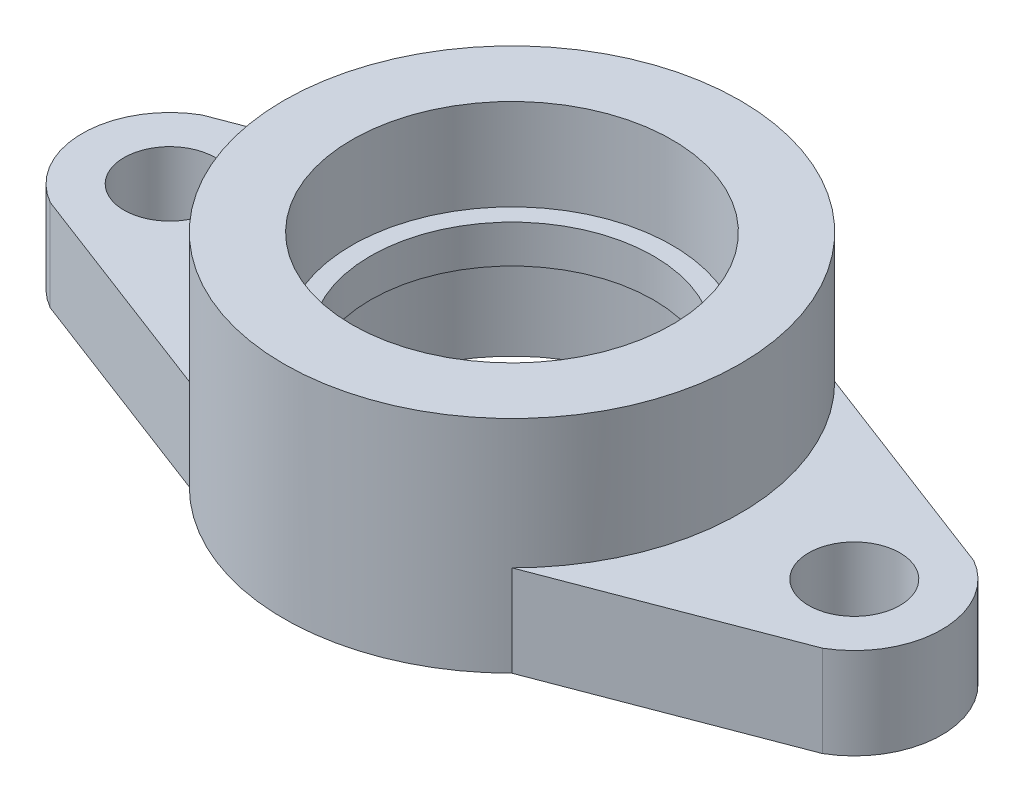
ISO-10303-21;
HEADER;
FILE_DESCRIPTION(('STEP AP214'),'2;1');
FILE_NAME('part.step','',(''),(''),'','','');
FILE_SCHEMA(('AUTOMOTIVE_DESIGN { 1 0 10303 214 1 1 1 1 }'));
ENDSEC;
DATA;
#1=APPLICATION_CONTEXT('core data for automotive mechanical design processes');
#2=APPLICATION_PROTOCOL_DEFINITION('international standard','automotive_design',2000,#1);
#3=PRODUCT_CONTEXT('',#1,'mechanical');
#4=PRODUCT('Part','Part','',(#3));
#5=PRODUCT_RELATED_PRODUCT_CATEGORY('part','',(#4));
#6=PRODUCT_DEFINITION_FORMATION('','',#4);
#7=PRODUCT_DEFINITION_CONTEXT('part definition',#1,'design');
#8=PRODUCT_DEFINITION('design','',#6,#7);
#9=PRODUCT_DEFINITION_SHAPE('','',#8);
#10=(LENGTH_UNIT() NAMED_UNIT(*) SI_UNIT(.MILLI.,.METRE.));
#11=(NAMED_UNIT(*) PLANE_ANGLE_UNIT() SI_UNIT($,.RADIAN.));
#12=(NAMED_UNIT(*) SI_UNIT($,.STERADIAN.) SOLID_ANGLE_UNIT());
#13=UNCERTAINTY_MEASURE_WITH_UNIT(LENGTH_MEASURE(1.E-05),#10,'distance_accuracy_value','');
#14=(GEOMETRIC_REPRESENTATION_CONTEXT(3) GLOBAL_UNCERTAINTY_ASSIGNED_CONTEXT((#13)) GLOBAL_UNIT_ASSIGNED_CONTEXT((#10,
#11,#12)) REPRESENTATION_CONTEXT('',''));
#15=CARTESIAN_POINT('',(0.,0.,0.));
#16=DIRECTION('',(0.,0.,1.));
#17=DIRECTION('',(1.,0.,0.));
#18=AXIS2_PLACEMENT_3D('',#15,#16,#17);
#19=CARTESIAN_POINT('',(45.,12.,0.));
#20=DIRECTION('',(0.,-1.,0.));
#21=DIRECTION('',(0.,0.,-1.));
#22=AXIS2_PLACEMENT_3D('',#19,#20,#21);
#23=PLANE('',#22);
#24=DIRECTION('',(-0.934468806462476,0.,0.356045010846375));
#25=VECTOR('',#24,1.);
#26=CARTESIAN_POINT('',(21.2132034355965,12.,21.2132034355964));
#27=LINE('',#26,#25);
#28=CARTESIAN_POINT('',(50.75,12.,9.95929214352107));
#29=VERTEX_POINT('',#28);
#30=CARTESIAN_POINT('',(21.2132034355965,12.,21.2132034355964));
#31=VERTEX_POINT('',#30);
#32=EDGE_CURVE('E100',#29,#31,#27,.T.);
#33=ORIENTED_EDGE('',*,*,#32,.F.);
#34=CARTESIAN_POINT('',(45.,12.,0.));
#35=DIRECTION('',(0.,1.,0.));
#36=DIRECTION('',(0.,0.,-1.));
#37=AXIS2_PLACEMENT_3D('',#34,#35,#36);
#38=CIRCLE('',#37,11.5);
#39=CARTESIAN_POINT('',(50.75,12.,-9.95929214352106));
#40=VERTEX_POINT('',#39);
#41=EDGE_CURVE('E128',#29,#40,#38,.T.);
#42=ORIENTED_EDGE('',*,*,#41,.T.);
#43=DIRECTION('',(-0.934468806462476,0.,-0.356045010846375));
#44=VECTOR('',#43,1.);
#45=CARTESIAN_POINT('',(21.2132034355965,12.,-21.2132034355964));
#46=LINE('',#45,#44);
#47=CARTESIAN_POINT('',(21.2132034355965,12.,-21.2132034355964));
#48=VERTEX_POINT('',#47);
#49=EDGE_CURVE('E55',#40,#48,#46,.T.);
#50=ORIENTED_EDGE('',*,*,#49,.T.);
#51=CARTESIAN_POINT('',(0.,12.,0.));
#52=DIRECTION('',(0.,1.,0.));
#53=DIRECTION('',(0.,0.,-1.));
#54=AXIS2_PLACEMENT_3D('',#51,#52,#53);
#55=CIRCLE('',#54,30.);
#56=EDGE_CURVE('E72',#31,#48,#55,.T.);
#57=ORIENTED_EDGE('',*,*,#56,.F.);
#58=EDGE_LOOP('',(#33,#42,#50,#57));
#59=FACE_BOUND('',#58,.T.);
#60=CARTESIAN_POINT('',(45.,12.,0.));
#61=DIRECTION('',(0.,-1.,0.));
#62=DIRECTION('',(0.,0.,-1.));
#63=AXIS2_PLACEMENT_3D('',#60,#61,#62);
#64=CIRCLE('',#63,6.00000000000001);
#65=CARTESIAN_POINT('',(45.,12.,-6.));
#66=VERTEX_POINT('',#65);
#67=EDGE_CURVE('E125',#66,#66,#64,.T.);
#68=ORIENTED_EDGE('',*,*,#67,.T.);
#69=EDGE_LOOP('',(#68));
#70=FACE_BOUND('',#69,.T.);
#71=ADVANCED_FACE('F38',(#59,#70),#23,.F.);
#72=CARTESIAN_POINT('',(45.,12.,0.));
#73=DIRECTION('',(0.,-1.,0.));
#74=DIRECTION('',(0.,0.,-1.));
#75=AXIS2_PLACEMENT_3D('',#72,#73,#74);
#76=CYLINDRICAL_SURFACE('',#75,6.00000000000001);
#77=CARTESIAN_POINT('',(45.,0.,0.));
#78=DIRECTION('',(0.,-1.,0.));
#79=DIRECTION('',(0.,0.,-1.));
#80=AXIS2_PLACEMENT_3D('',#77,#78,#79);
#81=CIRCLE('',#80,6.00000000000001);
#82=CARTESIAN_POINT('',(45.,0.,-6.));
#83=VERTEX_POINT('',#82);
#84=EDGE_CURVE('E123',#83,#83,#81,.T.);
#85=ORIENTED_EDGE('',*,*,#84,.T.);
#86=EDGE_LOOP('',(#85));
#87=FACE_BOUND('',#86,.T.);
#88=ORIENTED_EDGE('',*,*,#67,.F.);
#89=EDGE_LOOP('',(#88));
#90=FACE_BOUND('',#89,.T.);
#91=ADVANCED_FACE('F40',(#87,#90),#76,.F.);
#92=CARTESIAN_POINT('',(45.,12.,0.));
#93=DIRECTION('',(0.,-1.,0.));
#94=DIRECTION('',(0.,0.,-1.));
#95=AXIS2_PLACEMENT_3D('',#92,#93,#94);
#96=CYLINDRICAL_SURFACE('',#95,11.5);
#97=CARTESIAN_POINT('',(45.,0.,0.));
#98=DIRECTION('',(0.,1.,0.));
#99=DIRECTION('',(0.,0.,-1.));
#100=AXIS2_PLACEMENT_3D('',#97,#98,#99);
#101=CIRCLE('',#100,11.5);
#102=CARTESIAN_POINT('',(50.75,0.,9.95929214352107));
#103=VERTEX_POINT('',#102);
#104=CARTESIAN_POINT('',(50.75,0.,-9.95929214352106));
#105=VERTEX_POINT('',#104);
#106=EDGE_CURVE('E66',#103,#105,#101,.T.);
#107=ORIENTED_EDGE('',*,*,#106,.T.);
#108=DIRECTION('',(0.,-1.,0.));
#109=VECTOR('',#108,1.);
#110=CARTESIAN_POINT('',(50.75,12.,-9.95929214352106));
#111=LINE('',#110,#109);
#112=EDGE_CURVE('E11',#40,#105,#111,.T.);
#113=ORIENTED_EDGE('',*,*,#112,.F.);
#114=ORIENTED_EDGE('',*,*,#41,.F.);
#115=DIRECTION('',(0.,-1.,0.));
#116=VECTOR('',#115,1.);
#117=CARTESIAN_POINT('',(50.75,12.,9.95929214352107));
#118=LINE('',#117,#116);
#119=EDGE_CURVE('E107',#29,#103,#118,.T.);
#120=ORIENTED_EDGE('',*,*,#119,.T.);
#121=EDGE_LOOP('',(#107,#113,#114,#120));
#122=FACE_BOUND('',#121,.T.);
#123=ADVANCED_FACE('F235',(#122),#96,.T.);
#124=CARTESIAN_POINT('',(21.2132034355965,12.,-21.2132034355964));
#125=DIRECTION('',(-0.356045010846375,0.,0.934468806462476));
#126=DIRECTION('',(0.934468806462476,0.,0.356045010846375));
#127=AXIS2_PLACEMENT_3D('',#124,#125,#126);
#128=PLANE('',#127);
#129=DIRECTION('',(-0.934468806462476,0.,-0.356045010846375));
#130=VECTOR('',#129,1.);
#131=CARTESIAN_POINT('',(21.2132034355965,0.,-21.2132034355964));
#132=LINE('',#131,#130);
#133=CARTESIAN_POINT('',(21.2132034355965,0.,-21.2132034355964));
#134=VERTEX_POINT('',#133);
#135=EDGE_CURVE('E135',#105,#134,#132,.T.);
#136=ORIENTED_EDGE('',*,*,#135,.T.);
#137=DIRECTION('',(0.,-1.,0.));
#138=VECTOR('',#137,1.);
#139=CARTESIAN_POINT('',(21.2132034355965,12.,-21.2132034355964));
#140=LINE('',#139,#138);
#141=EDGE_CURVE('E47',#48,#134,#140,.T.);
#142=ORIENTED_EDGE('',*,*,#141,.F.);
#143=ORIENTED_EDGE('',*,*,#49,.F.);
#144=ORIENTED_EDGE('',*,*,#112,.T.);
#145=EDGE_LOOP('',(#136,#142,#143,#144));
#146=FACE_BOUND('',#145,.T.);
#147=ADVANCED_FACE('F227',(#146),#128,.F.);
#148=CARTESIAN_POINT('',(0.,12.,1.04083408558608E-13));
#149=DIRECTION('',(0.,-1.,0.));
#150=DIRECTION('',(0.,0.,-1.));
#151=AXIS2_PLACEMENT_3D('',#148,#149,#150);
#152=CYLINDRICAL_SURFACE('',#151,30.0000000000001);
#153=CARTESIAN_POINT('',(0.,0.,1.04083408558608E-13));
#154=DIRECTION('',(0.,1.,0.));
#155=DIRECTION('',(0.,0.,-1.));
#156=AXIS2_PLACEMENT_3D('',#153,#154,#155);
#157=CIRCLE('',#156,30.0000000000001);
#158=CARTESIAN_POINT('',(-21.2132034355965,0.,-21.2132034355964));
#159=VERTEX_POINT('',#158);
#160=EDGE_CURVE('E129',#134,#159,#157,.T.);
#161=ORIENTED_EDGE('',*,*,#160,.T.);
#162=DIRECTION('',(0.,-1.,0.));
#163=VECTOR('',#162,1.);
#164=CARTESIAN_POINT('',(-21.2132034355965,12.,-21.2132034355964));
#165=LINE('',#164,#163);
#166=CARTESIAN_POINT('',(-21.2132034355965,12.,-21.2132034355964));
#167=VERTEX_POINT('',#166);
#168=EDGE_CURVE('E115',#167,#159,#165,.T.);
#169=ORIENTED_EDGE('',*,*,#168,.F.);
#170=CARTESIAN_POINT('',(0.,12.,0.));
#171=DIRECTION('',(0.,-1.,0.));
#172=DIRECTION('',(0.,0.,-1.));
#173=AXIS2_PLACEMENT_3D('',#170,#171,#172);
#174=CIRCLE('',#173,30.);
#175=CARTESIAN_POINT('',(-21.2132034355965,12.,21.2132034355964));
#176=VERTEX_POINT('',#175);
#177=EDGE_CURVE('E170',#176,#167,#174,.T.);
#178=ORIENTED_EDGE('',*,*,#177,.F.);
#179=DIRECTION('',(0.,-1.,0.));
#180=VECTOR('',#179,1.);
#181=CARTESIAN_POINT('',(-21.2132034355965,12.,21.2132034355964));
#182=LINE('',#181,#180);
#183=CARTESIAN_POINT('',(-21.2132034355965,0.,21.2132034355964));
#184=VERTEX_POINT('',#183);
#185=EDGE_CURVE('E95',#176,#184,#182,.T.);
#186=ORIENTED_EDGE('',*,*,#185,.T.);
#187=CARTESIAN_POINT('',(0.,0.,-1.04083408558608E-13));
#188=DIRECTION('',(0.,-1.,0.));
#189=DIRECTION('',(0.,0.,1.));
#190=AXIS2_PLACEMENT_3D('',#187,#188,#189);
#191=CIRCLE('',#190,30.0000000000001);
#192=CARTESIAN_POINT('',(21.2132034355965,0.,21.2132034355964));
#193=VERTEX_POINT('',#192);
#194=EDGE_CURVE('E85',#193,#184,#191,.T.);
#195=ORIENTED_EDGE('',*,*,#194,.F.);
#196=DIRECTION('',(0.,-1.,0.));
#197=VECTOR('',#196,1.);
#198=CARTESIAN_POINT('',(21.2132034355965,12.,21.2132034355964));
#199=LINE('',#198,#197);
#200=EDGE_CURVE('E90',#31,#193,#199,.T.);
#201=ORIENTED_EDGE('',*,*,#200,.F.);
#202=ORIENTED_EDGE('',*,*,#56,.T.);
#203=ORIENTED_EDGE('',*,*,#141,.T.);
#204=EDGE_LOOP('',(#161,#169,#178,#186,#195,#201,#202,#203));
#205=FACE_BOUND('',#204,.T.);
#206=CARTESIAN_POINT('',(0.,29.,0.));
#207=DIRECTION('',(0.,1.,0.));
#208=DIRECTION('',(0.,0.,-1.));
#209=AXIS2_PLACEMENT_3D('',#206,#207,#208);
#210=CIRCLE('',#209,30.);
#211=CARTESIAN_POINT('',(0.,29.,-30.));
#212=VERTEX_POINT('',#211);
#213=EDGE_CURVE('E120',#212,#212,#210,.T.);
#214=ORIENTED_EDGE('',*,*,#213,.F.);
#215=EDGE_LOOP('',(#214));
#216=FACE_BOUND('',#215,.T.);
#217=ADVANCED_FACE('F88',(#205,#216),#152,.T.);
#218=CARTESIAN_POINT('',(45.,0.,0.));
#219=DIRECTION('',(0.,-1.,0.));
#220=DIRECTION('',(0.,0.,-1.));
#221=AXIS2_PLACEMENT_3D('',#218,#219,#220);
#222=PLANE('',#221);
#223=CARTESIAN_POINT('',(0.,0.,0.));
#224=DIRECTION('',(0.,1.,0.));
#225=DIRECTION('',(0.,0.,1.));
#226=AXIS2_PLACEMENT_3D('',#223,#224,#225);
#227=CIRCLE('',#226,21.05);
#228=CARTESIAN_POINT('',(0.,0.,21.05));
#229=VERTEX_POINT('',#228);
#230=EDGE_CURVE('E192',#229,#229,#227,.T.);
#231=ORIENTED_EDGE('',*,*,#230,.T.);
#232=EDGE_LOOP('',(#231));
#233=FACE_BOUND('',#232,.T.);
#234=ORIENTED_EDGE('',*,*,#106,.F.);
#235=DIRECTION('',(-0.934468806462476,0.,0.356045010846375));
#236=VECTOR('',#235,1.);
#237=CARTESIAN_POINT('',(21.2132034355965,0.,21.2132034355964));
#238=LINE('',#237,#236);
#239=EDGE_CURVE('E101',#103,#193,#238,.T.);
#240=ORIENTED_EDGE('',*,*,#239,.T.);
#241=ORIENTED_EDGE('',*,*,#194,.T.);
#242=DIRECTION('',(0.934468806462476,0.,0.356045010846375));
#243=VECTOR('',#242,1.);
#244=CARTESIAN_POINT('',(-21.2132034355965,0.,21.2132034355964));
#245=LINE('',#244,#243);
#246=CARTESIAN_POINT('',(-50.75,0.,9.95929214352106));
#247=VERTEX_POINT('',#246);
#248=EDGE_CURVE('E182',#247,#184,#245,.T.);
#249=ORIENTED_EDGE('',*,*,#248,.F.);
#250=CARTESIAN_POINT('',(-45.,0.,0.));
#251=DIRECTION('',(0.,-1.,0.));
#252=DIRECTION('',(0.,0.,-1.));
#253=AXIS2_PLACEMENT_3D('',#250,#251,#252);
#254=CIRCLE('',#253,11.5);
#255=CARTESIAN_POINT('',(-50.75,0.,-9.95929214352106));
#256=VERTEX_POINT('',#255);
#257=EDGE_CURVE('E149',#247,#256,#254,.T.);
#258=ORIENTED_EDGE('',*,*,#257,.T.);
#259=DIRECTION('',(0.934468806462476,0.,-0.356045010846375));
#260=VECTOR('',#259,1.);
#261=CARTESIAN_POINT('',(-21.2132034355965,0.,-21.2132034355964));
#262=LINE('',#261,#260);
#263=EDGE_CURVE('E146',#256,#159,#262,.T.);
#264=ORIENTED_EDGE('',*,*,#263,.T.);
#265=ORIENTED_EDGE('',*,*,#160,.F.);
#266=ORIENTED_EDGE('',*,*,#135,.F.);
#267=EDGE_LOOP('',(#234,#240,#241,#249,#258,#264,#265,#266));
#268=FACE_BOUND('',#267,.T.);
#269=ORIENTED_EDGE('',*,*,#84,.F.);
#270=EDGE_LOOP('',(#269));
#271=FACE_BOUND('',#270,.T.);
#272=CARTESIAN_POINT('',(-45.,0.,0.));
#273=DIRECTION('',(0.,1.,0.));
#274=DIRECTION('',(0.,0.,-1.));
#275=AXIS2_PLACEMENT_3D('',#272,#273,#274);
#276=CIRCLE('',#275,6.00000000000001);
#277=CARTESIAN_POINT('',(-45.,0.,-6.));
#278=VERTEX_POINT('',#277);
#279=EDGE_CURVE('E158',#278,#278,#276,.T.);
#280=ORIENTED_EDGE('',*,*,#279,.T.);
#281=EDGE_LOOP('',(#280));
#282=FACE_BOUND('',#281,.T.);
#283=ADVANCED_FACE('F109',(#233,#268,#271,#282),#222,.T.);
#284=CARTESIAN_POINT('',(0.,29.,0.));
#285=DIRECTION('',(0.,-1.,0.));
#286=DIRECTION('',(0.,0.,-1.));
#287=AXIS2_PLACEMENT_3D('',#284,#285,#286);
#288=PLANE('',#287);
#289=CARTESIAN_POINT('',(0.,29.,0.));
#290=DIRECTION('',(0.,1.,0.));
#291=DIRECTION('',(0.,0.,1.));
#292=AXIS2_PLACEMENT_3D('',#289,#290,#291);
#293=CIRCLE('',#292,21.05);
#294=CARTESIAN_POINT('',(0.,29.,21.05));
#295=VERTEX_POINT('',#294);
#296=EDGE_CURVE('E186',#295,#295,#293,.T.);
#297=ORIENTED_EDGE('',*,*,#296,.F.);
#298=EDGE_LOOP('',(#297));
#299=FACE_BOUND('',#298,.T.);
#300=ORIENTED_EDGE('',*,*,#213,.T.);
#301=EDGE_LOOP('',(#300));
#302=FACE_BOUND('',#301,.T.);
#303=ADVANCED_FACE('F221',(#299,#302),#288,.F.);
#304=CARTESIAN_POINT('',(21.2132034355965,12.,21.2132034355964));
#305=DIRECTION('',(-0.356045010846375,0.,-0.934468806462476));
#306=DIRECTION('',(0.934468806462476,0.,-0.356045010846375));
#307=AXIS2_PLACEMENT_3D('',#304,#305,#306);
#308=PLANE('',#307);
#309=ORIENTED_EDGE('',*,*,#239,.F.);
#310=ORIENTED_EDGE('',*,*,#119,.F.);
#311=ORIENTED_EDGE('',*,*,#32,.T.);
#312=ORIENTED_EDGE('',*,*,#200,.T.);
#313=EDGE_LOOP('',(#309,#310,#311,#312));
#314=FACE_BOUND('',#313,.T.);
#315=ADVANCED_FACE('F105',(#314),#308,.F.);
#316=CARTESIAN_POINT('',(-45.,12.,0.));
#317=DIRECTION('',(0.,-1.,0.));
#318=DIRECTION('',(0.,0.,-1.));
#319=AXIS2_PLACEMENT_3D('',#316,#317,#318);
#320=PLANE('',#319);
#321=CARTESIAN_POINT('',(-45.,12.,0.));
#322=DIRECTION('',(0.,-1.,0.));
#323=DIRECTION('',(0.,0.,-1.));
#324=AXIS2_PLACEMENT_3D('',#321,#322,#323);
#325=CIRCLE('',#324,11.5);
#326=CARTESIAN_POINT('',(-50.75,12.,9.95929214352106));
#327=VERTEX_POINT('',#326);
#328=CARTESIAN_POINT('',(-50.75,12.,-9.95929214352106));
#329=VERTEX_POINT('',#328);
#330=EDGE_CURVE('E156',#327,#329,#325,.T.);
#331=ORIENTED_EDGE('',*,*,#330,.F.);
#332=DIRECTION('',(0.934468806462476,0.,0.356045010846375));
#333=VECTOR('',#332,1.);
#334=CARTESIAN_POINT('',(-21.2132034355965,12.,21.2132034355964));
#335=LINE('',#334,#333);
#336=EDGE_CURVE('E181',#327,#176,#335,.T.);
#337=ORIENTED_EDGE('',*,*,#336,.T.);
#338=ORIENTED_EDGE('',*,*,#177,.T.);
#339=DIRECTION('',(0.934468806462476,0.,-0.356045010846375));
#340=VECTOR('',#339,1.);
#341=CARTESIAN_POINT('',(-21.2132034355965,12.,-21.2132034355964));
#342=LINE('',#341,#340);
#343=EDGE_CURVE('E162',#329,#167,#342,.T.);
#344=ORIENTED_EDGE('',*,*,#343,.F.);
#345=EDGE_LOOP('',(#331,#337,#338,#344));
#346=FACE_BOUND('',#345,.T.);
#347=CARTESIAN_POINT('',(-45.,12.,0.));
#348=DIRECTION('',(0.,1.,0.));
#349=DIRECTION('',(0.,0.,-1.));
#350=AXIS2_PLACEMENT_3D('',#347,#348,#349);
#351=CIRCLE('',#350,6.00000000000001);
#352=CARTESIAN_POINT('',(-45.,12.,-6.));
#353=VERTEX_POINT('',#352);
#354=EDGE_CURVE('E153',#353,#353,#351,.T.);
#355=ORIENTED_EDGE('',*,*,#354,.F.);
#356=EDGE_LOOP('',(#355));
#357=FACE_BOUND('',#356,.T.);
#358=ADVANCED_FACE('F247',(#346,#357),#320,.F.);
#359=CARTESIAN_POINT('',(-45.,12.,0.));
#360=DIRECTION('',(0.,-1.,0.));
#361=DIRECTION('',(0.,0.,-1.));
#362=AXIS2_PLACEMENT_3D('',#359,#360,#361);
#363=CYLINDRICAL_SURFACE('',#362,6.00000000000001);
#364=ORIENTED_EDGE('',*,*,#279,.F.);
#365=EDGE_LOOP('',(#364));
#366=FACE_BOUND('',#365,.T.);
#367=ORIENTED_EDGE('',*,*,#354,.T.);
#368=EDGE_LOOP('',(#367));
#369=FACE_BOUND('',#368,.T.);
#370=ADVANCED_FACE('F248',(#366,#369),#363,.F.);
#371=CARTESIAN_POINT('',(-45.,12.,0.));
#372=DIRECTION('',(0.,-1.,0.));
#373=DIRECTION('',(0.,0.,-1.));
#374=AXIS2_PLACEMENT_3D('',#371,#372,#373);
#375=CYLINDRICAL_SURFACE('',#374,11.5);
#376=ORIENTED_EDGE('',*,*,#257,.F.);
#377=DIRECTION('',(0.,-1.,0.));
#378=VECTOR('',#377,1.);
#379=CARTESIAN_POINT('',(-50.75,12.,9.95929214352106));
#380=LINE('',#379,#378);
#381=EDGE_CURVE('E173',#327,#247,#380,.T.);
#382=ORIENTED_EDGE('',*,*,#381,.F.);
#383=ORIENTED_EDGE('',*,*,#330,.T.);
#384=DIRECTION('',(0.,-1.,0.));
#385=VECTOR('',#384,1.);
#386=CARTESIAN_POINT('',(-50.75,12.,-9.95929214352106));
#387=LINE('',#386,#385);
#388=EDGE_CURVE('E112',#329,#256,#387,.T.);
#389=ORIENTED_EDGE('',*,*,#388,.T.);
#390=EDGE_LOOP('',(#376,#382,#383,#389));
#391=FACE_BOUND('',#390,.T.);
#392=ADVANCED_FACE('F251',(#391),#375,.T.);
#393=CARTESIAN_POINT('',(-21.2132034355965,12.,-21.2132034355964));
#394=DIRECTION('',(0.356045010846375,0.,0.934468806462476));
#395=DIRECTION('',(-0.934468806462476,0.,0.356045010846375));
#396=AXIS2_PLACEMENT_3D('',#393,#394,#395);
#397=PLANE('',#396);
#398=ORIENTED_EDGE('',*,*,#263,.F.);
#399=ORIENTED_EDGE('',*,*,#388,.F.);
#400=ORIENTED_EDGE('',*,*,#343,.T.);
#401=ORIENTED_EDGE('',*,*,#168,.T.);
#402=EDGE_LOOP('',(#398,#399,#400,#401));
#403=FACE_BOUND('',#402,.T.);
#404=ADVANCED_FACE('F255',(#403),#397,.F.);
#405=CARTESIAN_POINT('',(-21.2132034355965,12.,21.2132034355964));
#406=DIRECTION('',(0.356045010846375,0.,-0.934468806462476));
#407=DIRECTION('',(-0.934468806462476,0.,-0.356045010846375));
#408=AXIS2_PLACEMENT_3D('',#405,#406,#407);
#409=PLANE('',#408);
#410=ORIENTED_EDGE('',*,*,#248,.T.);
#411=ORIENTED_EDGE('',*,*,#185,.F.);
#412=ORIENTED_EDGE('',*,*,#336,.F.);
#413=ORIENTED_EDGE('',*,*,#381,.T.);
#414=EDGE_LOOP('',(#410,#411,#412,#413));
#415=FACE_BOUND('',#414,.T.);
#416=ADVANCED_FACE('F217',(#415),#409,.F.);
#417=CARTESIAN_POINT('',(0.,17.,0.));
#418=DIRECTION('',(0.,1.,0.));
#419=DIRECTION('',(0.,0.,1.));
#420=AXIS2_PLACEMENT_3D('',#417,#418,#419);
#421=CYLINDRICAL_SURFACE('',#420,21.05);
#422=CARTESIAN_POINT('',(0.,17.,0.));
#423=DIRECTION('',(0.,1.,0.));
#424=DIRECTION('',(0.,0.,1.));
#425=AXIS2_PLACEMENT_3D('',#422,#423,#424);
#426=CIRCLE('',#425,21.05);
#427=CARTESIAN_POINT('',(0.,17.,21.05));
#428=VERTEX_POINT('',#427);
#429=EDGE_CURVE('E184',#428,#428,#426,.T.);
#430=ORIENTED_EDGE('',*,*,#429,.F.);
#431=EDGE_LOOP('',(#430));
#432=FACE_BOUND('',#431,.T.);
#433=ORIENTED_EDGE('',*,*,#296,.T.);
#434=EDGE_LOOP('',(#433));
#435=FACE_BOUND('',#434,.T.);
#436=ADVANCED_FACE('F211',(#432,#435),#421,.F.);
#437=CARTESIAN_POINT('',(0.,17.,0.));
#438=DIRECTION('',(0.,1.,0.));
#439=DIRECTION('',(0.,0.,1.));
#440=AXIS2_PLACEMENT_3D('',#437,#438,#439);
#441=PLANE('',#440);
#442=CARTESIAN_POINT('',(0.,17.,0.));
#443=DIRECTION('',(0.,1.,0.));
#444=DIRECTION('',(0.,0.,1.));
#445=AXIS2_PLACEMENT_3D('',#442,#443,#444);
#446=CIRCLE('',#445,18.6);
#447=CARTESIAN_POINT('',(0.,17.,18.6));
#448=VERTEX_POINT('',#447);
#449=EDGE_CURVE('E200',#448,#448,#446,.T.);
#450=ORIENTED_EDGE('',*,*,#449,.F.);
#451=EDGE_LOOP('',(#450));
#452=FACE_BOUND('',#451,.T.);
#453=ORIENTED_EDGE('',*,*,#429,.T.);
#454=EDGE_LOOP('',(#453));
#455=FACE_BOUND('',#454,.T.);
#456=ADVANCED_FACE('F207',(#452,#455),#441,.T.);
#457=CARTESIAN_POINT('',(0.,12.,0.));
#458=DIRECTION('',(0.,-1.,0.));
#459=DIRECTION('',(0.,0.,-1.));
#460=AXIS2_PLACEMENT_3D('',#457,#458,#459);
#461=CYLINDRICAL_SURFACE('',#460,21.05);
#462=CARTESIAN_POINT('',(0.,12.,0.));
#463=DIRECTION('',(0.,1.,0.));
#464=DIRECTION('',(0.,0.,1.));
#465=AXIS2_PLACEMENT_3D('',#462,#463,#464);
#466=CIRCLE('',#465,21.05);
#467=CARTESIAN_POINT('',(0.,12.,21.05));
#468=VERTEX_POINT('',#467);
#469=EDGE_CURVE('E189',#468,#468,#466,.T.);
#470=ORIENTED_EDGE('',*,*,#469,.T.);
#471=EDGE_LOOP('',(#470));
#472=FACE_BOUND('',#471,.T.);
#473=ORIENTED_EDGE('',*,*,#230,.F.);
#474=EDGE_LOOP('',(#473));
#475=FACE_BOUND('',#474,.T.);
#476=ADVANCED_FACE('F210',(#472,#475),#461,.F.);
#477=CARTESIAN_POINT('',(0.,12.,0.));
#478=DIRECTION('',(0.,-1.,0.));
#479=DIRECTION('',(0.,0.,1.));
#480=AXIS2_PLACEMENT_3D('',#477,#478,#479);
#481=PLANE('',#480);
#482=CARTESIAN_POINT('',(0.,12.,0.));
#483=DIRECTION('',(0.,-1.,0.));
#484=DIRECTION('',(0.,0.,-1.));
#485=AXIS2_PLACEMENT_3D('',#482,#483,#484);
#486=CIRCLE('',#485,18.6);
#487=CARTESIAN_POINT('',(0.,12.,18.6));
#488=VERTEX_POINT('',#487);
#489=EDGE_CURVE('E195',#488,#488,#486,.F.);
#490=ORIENTED_EDGE('',*,*,#489,.T.);
#491=EDGE_LOOP('',(#490));
#492=FACE_BOUND('',#491,.T.);
#493=ORIENTED_EDGE('',*,*,#469,.F.);
#494=EDGE_LOOP('',(#493));
#495=FACE_BOUND('',#494,.T.);
#496=ADVANCED_FACE('F266',(#492,#495),#481,.T.);
#497=CARTESIAN_POINT('',(0.,-40.6087445202791,0.));
#498=DIRECTION('',(0.,1.,0.));
#499=DIRECTION('',(0.,0.,1.));
#500=AXIS2_PLACEMENT_3D('',#497,#498,#499);
#501=CYLINDRICAL_SURFACE('',#500,18.6);
#502=CARTESIAN_POINT('',(0.,17.,18.6));
#503=CARTESIAN_POINT('',(0.,16.9479166666667,18.6));
#504=CARTESIAN_POINT('',(0.,16.8958333333333,18.6));
#505=CARTESIAN_POINT('',(0.,16.7916666666667,18.6));
#506=CARTESIAN_POINT('',(0.,16.7395833333333,18.6));
#507=CARTESIAN_POINT('',(0.,16.6354166666667,18.6));
#508=CARTESIAN_POINT('',(0.,16.5833333333333,18.6));
#509=CARTESIAN_POINT('',(0.,16.4791666666667,18.6));
#510=CARTESIAN_POINT('',(0.,16.4270833333333,18.6));
#511=CARTESIAN_POINT('',(0.,16.3229166666667,18.6));
#512=CARTESIAN_POINT('',(0.,16.2708333333333,18.6));
#513=CARTESIAN_POINT('',(0.,16.1666666666667,18.6));
#514=CARTESIAN_POINT('',(0.,16.1145833333333,18.6));
#515=CARTESIAN_POINT('',(0.,16.0104166666667,18.6));
#516=CARTESIAN_POINT('',(0.,15.9583333333333,18.6));
#517=CARTESIAN_POINT('',(0.,15.8541666666667,18.6));
#518=CARTESIAN_POINT('',(0.,15.8020833333333,18.6));
#519=CARTESIAN_POINT('',(0.,15.6979166666667,18.6));
#520=CARTESIAN_POINT('',(0.,15.6458333333333,18.6));
#521=CARTESIAN_POINT('',(0.,15.5416666666667,18.6));
#522=CARTESIAN_POINT('',(0.,15.4895833333333,18.6));
#523=CARTESIAN_POINT('',(0.,15.3854166666667,18.6));
#524=CARTESIAN_POINT('',(0.,15.3333333333333,18.6));
#525=CARTESIAN_POINT('',(0.,15.2291666666667,18.6));
#526=CARTESIAN_POINT('',(0.,15.1770833333333,18.6));
#527=CARTESIAN_POINT('',(0.,15.0729166666667,18.6));
#528=CARTESIAN_POINT('',(0.,15.0208333333333,18.6));
#529=CARTESIAN_POINT('',(0.,14.9166666666667,18.6));
#530=CARTESIAN_POINT('',(0.,14.8645833333333,18.6));
#531=CARTESIAN_POINT('',(0.,14.7604166666667,18.6));
#532=CARTESIAN_POINT('',(0.,14.7083333333333,18.6));
#533=CARTESIAN_POINT('',(0.,14.6041666666667,18.6));
#534=CARTESIAN_POINT('',(0.,14.5520833333333,18.6));
#535=CARTESIAN_POINT('',(0.,14.4479166666667,18.6));
#536=CARTESIAN_POINT('',(0.,14.3958333333333,18.6));
#537=CARTESIAN_POINT('',(0.,14.2916666666667,18.6));
#538=CARTESIAN_POINT('',(0.,14.2395833333333,18.6));
#539=CARTESIAN_POINT('',(0.,14.1354166666667,18.6));
#540=CARTESIAN_POINT('',(0.,14.0833333333333,18.6));
#541=CARTESIAN_POINT('',(0.,13.9791666666667,18.6));
#542=CARTESIAN_POINT('',(0.,13.9270833333333,18.6));
#543=CARTESIAN_POINT('',(0.,13.8229166666667,18.6));
#544=CARTESIAN_POINT('',(0.,13.7708333333333,18.6));
#545=CARTESIAN_POINT('',(0.,13.6666666666667,18.6));
#546=CARTESIAN_POINT('',(0.,13.6145833333333,18.6));
#547=CARTESIAN_POINT('',(0.,13.5104166666667,18.6));
#548=CARTESIAN_POINT('',(0.,13.4583333333333,18.6));
#549=CARTESIAN_POINT('',(0.,13.3541666666667,18.6));
#550=CARTESIAN_POINT('',(0.,13.3020833333333,18.6));
#551=CARTESIAN_POINT('',(0.,13.1979166666667,18.6));
#552=CARTESIAN_POINT('',(0.,13.1458333333333,18.6));
#553=CARTESIAN_POINT('',(0.,13.0416666666667,18.6));
#554=CARTESIAN_POINT('',(0.,12.9895833333333,18.6));
#555=CARTESIAN_POINT('',(0.,12.8854166666667,18.6));
#556=CARTESIAN_POINT('',(0.,12.8333333333333,18.6));
#557=CARTESIAN_POINT('',(0.,12.7291666666667,18.6));
#558=CARTESIAN_POINT('',(0.,12.6770833333333,18.6));
#559=CARTESIAN_POINT('',(0.,12.5729166666667,18.6));
#560=CARTESIAN_POINT('',(0.,12.5208333333333,18.6));
#561=CARTESIAN_POINT('',(0.,12.4166666666667,18.6));
#562=CARTESIAN_POINT('',(0.,12.3645833333333,18.6));
#563=CARTESIAN_POINT('',(0.,12.2604166666667,18.6));
#564=CARTESIAN_POINT('',(0.,12.2083333333333,18.6));
#565=CARTESIAN_POINT('',(0.,12.1041666666667,18.6));
#566=CARTESIAN_POINT('',(0.,12.0520833333333,18.6));
#567=CARTESIAN_POINT('',(0.,12.,18.6));
#568=B_SPLINE_CURVE_WITH_KNOTS('',3,(#502,#503,#504,#505,#506,#507,#508,#509,#510,#511,#512,
#513,#514,#515,#516,#517,#518,#519,#520,#521,#522,#523,#524,#525,#526,#527,#528,#529,#530,#531,
#532,#533,#534,#535,#536,#537,#538,#539,#540,#541,#542,#543,#544,#545,#546,#547,#548,#549,#550,
#551,#552,#553,#554,#555,#556,#557,#558,#559,#560,#561,#562,#563,#564,#565,#566,#567),
.UNSPECIFIED.,.F.,.F.,(4,2,2,2,2,2,2,2,2,2,2,2,2,2,2,2,2,2,2,2,2,2,2,2,2,2,2,2,2,2,2,2,4),(0.,
0.156249999999997,0.3125,0.468749999999997,0.625000000000001,0.781249999999997,
0.937500000000001,1.09375,1.25,1.40625,1.56249999999999,1.71875,1.87499999999999,2.03125,2.1875,
2.34375,2.5,2.65624999999999,2.8125,2.96874999999999,3.125,3.28124999999999,3.4375,
3.59374999999999,3.74999999999999,3.90624999999999,4.06249999999999,4.21874999999999,
4.37499999999999,4.53124999999999,4.68749999999999,4.84374999999999,4.99999999999999),.UNSPECIFIED.);
#569=EDGE_CURVE('BSEAM204',#448,#488,#568,.T.);
#570=ORIENTED_EDGE('',*,*,#449,.T.);
#571=ORIENTED_EDGE('',*,*,#489,.F.);
#572=ORIENTED_EDGE('',*,*,#569,.T.);
#573=ORIENTED_EDGE('',*,*,#569,.F.);
#574=EDGE_LOOP('',(#570,#572,#571,#573));
#575=FACE_BOUND('',#574,.T.);
#576=ADVANCED_FACE('F204',(#575),#501,.F.);
#577=CLOSED_SHELL('',(#71,#91,#123,#147,#217,#283,#303,#315,#358,#370,#392,#404,#416,#436,#456,
#476,#496,#576));
#578=MANIFOLD_SOLID_BREP('B2',#577);
#579=ADVANCED_BREP_SHAPE_REPRESENTATION('',(#18,#578),#14);
#580=SHAPE_DEFINITION_REPRESENTATION(#9,#579);
ENDSEC;
END-ISO-10303-21;
